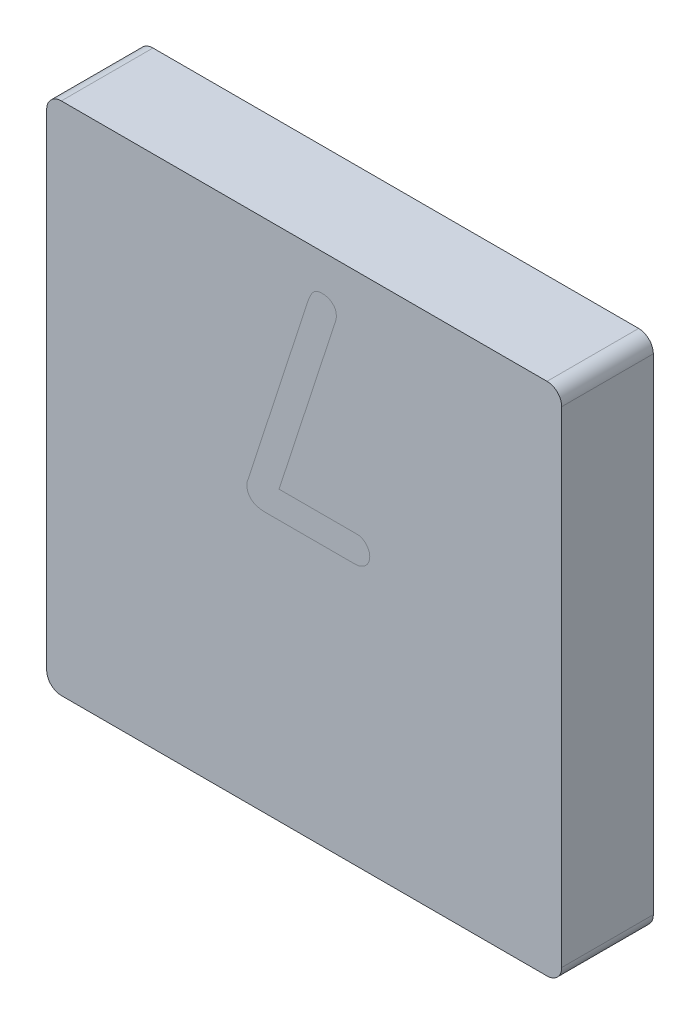
ISO-10303-21;
HEADER;
FILE_DESCRIPTION(('STEP AP214'),'2;1');
FILE_NAME('part.step','',(''),(''),'','','');
FILE_SCHEMA(('AUTOMOTIVE_DESIGN { 1 0 10303 214 1 1 1 1 }'));
ENDSEC;
DATA;
#1=APPLICATION_CONTEXT('core data for automotive mechanical design processes');
#2=APPLICATION_PROTOCOL_DEFINITION('international standard','automotive_design',2000,#1);
#3=PRODUCT_CONTEXT('',#1,'mechanical');
#4=PRODUCT('Part','Part','',(#3));
#5=PRODUCT_RELATED_PRODUCT_CATEGORY('part','',(#4));
#6=PRODUCT_DEFINITION_FORMATION('','',#4);
#7=PRODUCT_DEFINITION_CONTEXT('part definition',#1,'design');
#8=PRODUCT_DEFINITION('design','',#6,#7);
#9=PRODUCT_DEFINITION_SHAPE('','',#8);
#10=(LENGTH_UNIT() NAMED_UNIT(*) SI_UNIT(.MILLI.,.METRE.));
#11=(NAMED_UNIT(*) PLANE_ANGLE_UNIT() SI_UNIT($,.RADIAN.));
#12=(NAMED_UNIT(*) SI_UNIT($,.STERADIAN.) SOLID_ANGLE_UNIT());
#13=UNCERTAINTY_MEASURE_WITH_UNIT(LENGTH_MEASURE(1.E-05),#10,'distance_accuracy_value','');
#14=(GEOMETRIC_REPRESENTATION_CONTEXT(3) GLOBAL_UNCERTAINTY_ASSIGNED_CONTEXT((#13)) GLOBAL_UNIT_ASSIGNED_CONTEXT((#10,
#11,#12)) REPRESENTATION_CONTEXT('',''));
#15=CARTESIAN_POINT('',(0.,0.,0.));
#16=DIRECTION('',(0.,0.,1.));
#17=DIRECTION('',(1.,0.,0.));
#18=AXIS2_PLACEMENT_3D('',#15,#16,#17);
#19=CARTESIAN_POINT('',(4.207,4.207,1.58750000000002));
#20=DIRECTION('',(0.,0.,1.));
#21=DIRECTION('',(1.,0.,0.));
#22=AXIS2_PLACEMENT_3D('',#19,#20,#21);
#23=PLANE('',#22);
#24=CARTESIAN_POINT('',(4.207,4.207,1.58750000000002));
#25=DIRECTION('',(0.,0.,1.));
#26=DIRECTION('',(1.,0.,0.));
#27=AXIS2_PLACEMENT_3D('',#24,#25,#26);
#28=CIRCLE('',#27,0.254000000000002);
#29=CARTESIAN_POINT('',(4.46100000000001,4.207,1.58750000000002));
#30=VERTEX_POINT('',#29);
#31=CARTESIAN_POINT('',(4.207,4.46099999999999,1.58750000000002));
#32=VERTEX_POINT('',#31);
#33=EDGE_CURVE('E151',#30,#32,#28,.T.);
#34=ORIENTED_EDGE('',*,*,#33,.T.);
#35=DIRECTION('',(-1.,0.,0.));
#36=VECTOR('',#35,1.);
#37=CARTESIAN_POINT('',(4.207,4.46099999999999,1.58750000000002));
#38=LINE('',#37,#36);
#39=CARTESIAN_POINT('',(-4.207,4.46099999999999,1.58750000000002));
#40=VERTEX_POINT('',#39);
#41=EDGE_CURVE('E140',#32,#40,#38,.T.);
#42=ORIENTED_EDGE('',*,*,#41,.T.);
#43=CARTESIAN_POINT('',(-4.207,4.207,1.58750000000002));
#44=DIRECTION('',(0.,0.,1.));
#45=DIRECTION('',(1.,0.,0.));
#46=AXIS2_PLACEMENT_3D('',#43,#44,#45);
#47=CIRCLE('',#46,0.254);
#48=CARTESIAN_POINT('',(-4.46100000000001,4.207,1.58750000000002));
#49=VERTEX_POINT('',#48);
#50=EDGE_CURVE('E150',#40,#49,#47,.T.);
#51=ORIENTED_EDGE('',*,*,#50,.T.);
#52=DIRECTION('',(0.,-1.,0.));
#53=VECTOR('',#52,1.);
#54=CARTESIAN_POINT('',(-4.46100000000001,4.207,1.58750000000002));
#55=LINE('',#54,#53);
#56=CARTESIAN_POINT('',(-4.46100000000001,-4.207,1.58750000000002));
#57=VERTEX_POINT('',#56);
#58=EDGE_CURVE('E334',#49,#57,#55,.T.);
#59=ORIENTED_EDGE('',*,*,#58,.T.);
#60=CARTESIAN_POINT('',(-4.207,-4.207,1.58750000000002));
#61=DIRECTION('',(0.,0.,1.));
#62=DIRECTION('',(1.,0.,0.));
#63=AXIS2_PLACEMENT_3D('',#60,#61,#62);
#64=CIRCLE('',#63,0.254000000000003);
#65=CARTESIAN_POINT('',(-4.207,-4.46100000000001,1.58750000000002));
#66=VERTEX_POINT('',#65);
#67=EDGE_CURVE('E348',#57,#66,#64,.T.);
#68=ORIENTED_EDGE('',*,*,#67,.T.);
#69=DIRECTION('',(1.,0.,0.));
#70=VECTOR('',#69,1.);
#71=CARTESIAN_POINT('',(-4.207,-4.46099999999999,1.58750000000002));
#72=LINE('',#71,#70);
#73=CARTESIAN_POINT('',(4.207,-4.46099999999999,1.58750000000002));
#74=VERTEX_POINT('',#73);
#75=EDGE_CURVE('E346',#66,#74,#72,.T.);
#76=ORIENTED_EDGE('',*,*,#75,.T.);
#77=CARTESIAN_POINT('',(4.207,-4.207,1.58750000000002));
#78=DIRECTION('',(0.,0.,1.));
#79=DIRECTION('',(1.,0.,0.));
#80=AXIS2_PLACEMENT_3D('',#77,#78,#79);
#81=CIRCLE('',#80,0.254);
#82=CARTESIAN_POINT('',(4.46100000000001,-4.207,1.58750000000002));
#83=VERTEX_POINT('',#82);
#84=EDGE_CURVE('E350',#74,#83,#81,.T.);
#85=ORIENTED_EDGE('',*,*,#84,.T.);
#86=DIRECTION('',(0.,1.,0.));
#87=VECTOR('',#86,1.);
#88=CARTESIAN_POINT('',(4.46100000000001,-4.207,1.58750000000002));
#89=LINE('',#88,#87);
#90=EDGE_CURVE('E156',#83,#30,#89,.T.);
#91=ORIENTED_EDGE('',*,*,#90,.T.);
#92=EDGE_LOOP('',(#34,#42,#51,#59,#68,#76,#85,#91));
#93=FACE_BOUND('',#92,.T.);
#94=DIRECTION('',(-0.309222416613716,-0.950989746034926,0.));
#95=VECTOR('',#94,1.);
#96=CARTESIAN_POINT('',(1.09230443226494,5.21976979534929,1.58750000000002));
#97=LINE('',#96,#95);
#98=CARTESIAN_POINT('',(0.512438674508044,3.43643728103016,1.58750000000002));
#99=VERTEX_POINT('',#98);
#100=CARTESIAN_POINT('',(-0.435348841176977,0.521589713680826,1.58750000000002));
#101=VERTEX_POINT('',#100);
#102=EDGE_CURVE('E49',#99,#101,#97,.T.);
#103=ORIENTED_EDGE('',*,*,#102,.T.);
#104=DIRECTION('',(0.999999999999225,-1.24544323449292E-06,0.));
#105=VECTOR('',#104,1.);
#106=CARTESIAN_POINT('',(4.20699541002349,0.521583931904587,1.58750000000002));
#107=LINE('',#106,#105);
#108=CARTESIAN_POINT('',(0.852277973472496,0.521588110014723,1.58750000000002));
#109=VERTEX_POINT('',#108);
#110=EDGE_CURVE('E11',#101,#109,#107,.T.);
#111=ORIENTED_EDGE('',*,*,#110,.T.);
#112=CARTESIAN_POINT('',(1.00007184170472,0.504345492054289,1.58750000000002));
#113=CARTESIAN_POINT('',(0.991697495146514,0.507963446719439,1.58750000000002));
#114=CARTESIAN_POINT('',(0.975615751850768,0.514911214855862,1.58750000000002));
#115=CARTESIAN_POINT('',(0.946108342943654,0.520465651645374,1.58750000000002));
#116=CARTESIAN_POINT('',(0.905089407239545,0.520800409618521,1.58750000000002));
#117=CARTESIAN_POINT('',(0.872522688656494,0.521286153240708,1.58750000000002));
#118=CARTESIAN_POINT('',(0.852277973472496,0.521588110014723,1.58750000000002));
#119=B_SPLINE_CURVE_WITH_KNOTS('',3,(#112,#113,#114,#115,#116,#117,#118),.UNSPECIFIED.,.F.,.F.,
(4,1,1,1,4),(0.,0.181760158057884,0.349044571175198,0.595341261649439,1.),.UNSPECIFIED.);
#120=CARTESIAN_POINT('',(1.00007184170472,0.504345492054289,1.58750000000002));
#121=VERTEX_POINT('',#120);
#122=EDGE_CURVE('E164',#109,#121,#119,.F.);
#123=ORIENTED_EDGE('',*,*,#122,.T.);
#124=CARTESIAN_POINT('',(1.13637063129666,0.293328691300498,1.58750000000002));
#125=CARTESIAN_POINT('',(1.13454225660089,0.315891885064215,1.58750000000002));
#126=CARTESIAN_POINT('',(1.13090621240871,0.360762758540759,1.58750000000002));
#127=CARTESIAN_POINT('',(1.09970362721891,0.420743053288375,1.58750000000002));
#128=CARTESIAN_POINT('',(1.05811085615027,0.473144865431305,1.58750000000002));
#129=CARTESIAN_POINT('',(1.01933048817938,0.493992424489997,1.58750000000002));
#130=CARTESIAN_POINT('',(1.00007184170472,0.504345492054289,1.58750000000002));
#131=B_SPLINE_CURVE_WITH_KNOTS('',3,(#124,#125,#126,#127,#128,#129,#130),.UNSPECIFIED.,.F.,.F.,
(4,1,1,1,4),(0.,0.254240813759355,0.505602509389392,0.754478180898699,1.),.UNSPECIFIED.);
#132=CARTESIAN_POINT('',(1.13637063129666,0.293328691300498,1.58750000000002));
#133=VERTEX_POINT('',#132);
#134=EDGE_CURVE('E168',#121,#133,#131,.F.);
#135=ORIENTED_EDGE('',*,*,#134,.T.);
#136=CARTESIAN_POINT('',(0.971334145104009,0.0716378889521613,1.58750000000002));
#137=CARTESIAN_POINT('',(0.995452004098112,0.0826025554476473,1.58750000000002));
#138=CARTESIAN_POINT('',(1.04120556890481,0.103403430815857,1.58750000000002));
#139=CARTESIAN_POINT('',(1.09466482083021,0.155193860475147,1.58750000000002));
#140=CARTESIAN_POINT('',(1.12920650305696,0.219969691161115,1.58750000000002));
#141=CARTESIAN_POINT('',(1.13392260130277,0.268261435850209,1.58750000000002));
#142=CARTESIAN_POINT('',(1.13637063129666,0.293328691300498,1.58750000000002));
#143=B_SPLINE_CURVE_WITH_KNOTS('',3,(#136,#137,#138,#139,#140,#141,#142),.UNSPECIFIED.,.F.,.F.,
(4,1,1,1,4),(0.,0.268477384834813,0.509323710250489,0.745299989102933,1.),.UNSPECIFIED.);
#144=CARTESIAN_POINT('',(0.971334145104009,0.0716378889521613,1.58750000000002));
#145=VERTEX_POINT('',#144);
#146=EDGE_CURVE('E184',#133,#145,#143,.F.);
#147=ORIENTED_EDGE('',*,*,#146,.T.);
#148=CARTESIAN_POINT('',(0.801882766124432,0.0552171498705289,1.58750000000002));
#149=CARTESIAN_POINT('',(0.823886136588473,0.0551159039009347,1.58750000000002));
#150=CARTESIAN_POINT('',(0.860682263173637,0.0549465907714181,1.58750000000002));
#151=CARTESIAN_POINT('',(0.907957907446015,0.0558184733714107,1.58750000000002));
#152=CARTESIAN_POINT('',(0.943122203816406,0.0603831142720196,1.58750000000002));
#153=CARTESIAN_POINT('',(0.962135560278118,0.067968237206617,1.58750000000002));
#154=CARTESIAN_POINT('',(0.971334145104009,0.0716378889521613,1.58750000000002));
#155=B_SPLINE_CURVE_WITH_KNOTS('',3,(#148,#149,#150,#151,#152,#153,#154),.UNSPECIFIED.,.F.,.F.,
(4,1,1,1,4),(0.,0.384688684528218,0.643312966752675,0.827436258388912,1.),.UNSPECIFIED.);
#156=CARTESIAN_POINT('',(0.801882766124432,0.0552171498705289,1.58750000000002));
#157=VERTEX_POINT('',#156);
#158=EDGE_CURVE('E193',#145,#157,#155,.F.);
#159=ORIENTED_EDGE('',*,*,#158,.T.);
#160=DIRECTION('',(-0.99999999999985,-5.47516192907888E-07,0.));
#161=VECTOR('',#160,1.);
#162=CARTESIAN_POINT('',(4.20700227316732,0.0552190142285996,1.58750000000002));
#163=LINE('',#162,#161);
#164=CARTESIAN_POINT('',(-0.662609175907804,0.0552163480374707,1.58750000000002));
#165=VERTEX_POINT('',#164);
#166=EDGE_CURVE('E202',#157,#165,#163,.T.);
#167=ORIENTED_EDGE('',*,*,#166,.T.);
#168=CARTESIAN_POINT('',(-0.991861071247373,0.310571309260932,1.58750000000002));
#169=CARTESIAN_POINT('',(-0.990725733000006,0.29076498491365,1.58750000000002));
#170=CARTESIAN_POINT('',(-0.988557647972899,0.252942075874035,1.58750000000002));
#171=CARTESIAN_POINT('',(-0.973052143044051,0.199759914801451,1.58750000000002));
#172=CARTESIAN_POINT('',(-0.945795671818218,0.154871630157205,1.58750000000002));
#173=CARTESIAN_POINT('',(-0.908740210579739,0.117808826928162,1.58750000000002));
#174=CARTESIAN_POINT('',(-0.861085160899736,0.0893661366867249,1.58750000000002));
#175=CARTESIAN_POINT('',(-0.803339592421445,0.0704125067194084,1.58750000000002));
#176=CARTESIAN_POINT('',(-0.736191145501885,0.0581118285341853,1.58750000000002));
#177=CARTESIAN_POINT('',(-0.688123579681649,0.0562203502260522,1.58750000000002));
#178=CARTESIAN_POINT('',(-0.662609175907804,0.0552163480374707,1.58750000000002));
#179=B_SPLINE_CURVE_WITH_KNOTS('',3,(#168,#169,#170,#171,#172,#173,#174,#175,#176,#177,#178),
.UNSPECIFIED.,.F.,.F.,(4,1,1,1,1,1,1,1,4),(0.,0.125498406788053,0.23965652290319,
0.347063440867895,0.455015397762931,0.568671485243392,0.695410826787818,0.838323180758934,1.),.UNSPECIFIED.);
#180=CARTESIAN_POINT('',(-0.991861071247373,0.310571309260932,1.58750000000002));
#181=VERTEX_POINT('',#180);
#182=EDGE_CURVE('E209',#165,#181,#179,.F.);
#183=ORIENTED_EDGE('',*,*,#182,.T.);
#184=CARTESIAN_POINT('',(-0.968834029646391,0.410551872574064,1.58750000000002));
#185=CARTESIAN_POINT('',(-0.973277138125818,0.398880187734263,1.58750000000002));
#186=CARTESIAN_POINT('',(-0.980673785100757,0.379449797330234,1.58750000000002));
#187=CARTESIAN_POINT('',(-0.989856114535864,0.353472389273538,1.58750000000002));
#188=CARTESIAN_POINT('',(-0.992354267948803,0.331422286339256,1.58750000000002));
#189=CARTESIAN_POINT('',(-0.992029382801872,0.317687051022225,1.58750000000002));
#190=CARTESIAN_POINT('',(-0.991861071247373,0.310571309260932,1.58750000000002));
#191=B_SPLINE_CURVE_WITH_KNOTS('',3,(#184,#185,#186,#187,#188,#189,#190),.UNSPECIFIED.,.F.,.F.,
(4,1,1,1,4),(0.,0.361866898991394,0.602416464993032,0.794025970553256,1.),.UNSPECIFIED.);
#192=CARTESIAN_POINT('',(-0.968834029646391,0.410551872574064,1.58750000000002));
#193=VERTEX_POINT('',#192);
#194=EDGE_CURVE('E215',#181,#193,#191,.F.);
#195=ORIENTED_EDGE('',*,*,#194,.T.);
#196=DIRECTION('',(0.308858184046078,0.951108102240623,0.));
#197=VECTOR('',#196,1.);
#198=CARTESIAN_POINT('',(0.640141453261155,5.36528416443906,1.58750000000002));
#199=LINE('',#198,#197);
#200=CARTESIAN_POINT('',(0.0582964702471531,3.57353148901016,1.58750000000002));
#201=VERTEX_POINT('',#200);
#202=EDGE_CURVE('E224',#193,#201,#199,.T.);
#203=ORIENTED_EDGE('',*,*,#202,.T.);
#204=CARTESIAN_POINT('',(0.325146510110896,3.83217075841655,1.58750000000002));
#205=CARTESIAN_POINT('',(0.308955036949415,3.83221539515127,1.58750000000002));
#206=CARTESIAN_POINT('',(0.278185689554067,3.83230022024307,1.58750000000002));
#207=CARTESIAN_POINT('',(0.234589990729395,3.82319294264365,1.58750000000002));
#208=CARTESIAN_POINT('',(0.196596965456666,3.80668505839733,1.58750000000002));
#209=CARTESIAN_POINT('',(0.163546654677799,3.78143495971875,1.58750000000002));
#210=CARTESIAN_POINT('',(0.135331394142721,3.7457288329321,1.58750000000002));
#211=CARTESIAN_POINT('',(0.108055688902396,3.69964426113635,1.58750000000002));
#212=CARTESIAN_POINT('',(0.082431586213412,3.64087852940474,1.58750000000002));
#213=CARTESIAN_POINT('',(0.0667687666005418,3.59717272966316,1.58750000000002));
#214=CARTESIAN_POINT('',(0.0582964702471531,3.57353148901016,1.58750000000002));
#215=B_SPLINE_CURVE_WITH_KNOTS('',3,(#204,#205,#206,#207,#208,#209,#210,#211,#212,#213,#214),
.UNSPECIFIED.,.F.,.F.,(4,1,1,1,1,1,1,1,4),(0.,0.11895441220544,0.226054145713362,
0.325282327952042,0.421603612629503,0.528930573550234,0.658174846496339,0.815100724320157,1.),.UNSPECIFIED.);
#216=CARTESIAN_POINT('',(0.325146510110896,3.83217075841655,1.58750000000002));
#217=VERTEX_POINT('',#216);
#218=EDGE_CURVE('E231',#201,#217,#215,.F.);
#219=ORIENTED_EDGE('',*,*,#218,.T.);
#220=CARTESIAN_POINT('',(0.55751131405378,3.6244382658457,1.58750000000002));
#221=CARTESIAN_POINT('',(0.556154076510787,3.6390394154783,1.58750000000002));
#222=CARTESIAN_POINT('',(0.55351230753882,3.66745954300389,1.58750000000002));
#223=CARTESIAN_POINT('',(0.540253528488827,3.70777093757024,1.58750000000002));
#224=CARTESIAN_POINT('',(0.518132344629184,3.74334100428236,1.58750000000002));
#225=CARTESIAN_POINT('',(0.488141992232148,3.77331572270762,1.58750000000002));
#226=CARTESIAN_POINT('',(0.453412283039717,3.79877459722427,1.58750000000002));
#227=CARTESIAN_POINT('',(0.41373509899012,3.8170661306569,1.58750000000002));
#228=CARTESIAN_POINT('',(0.370675267493195,3.82879385570641,1.58750000000002));
#229=CARTESIAN_POINT('',(0.340547806066974,3.8310284325319,1.58750000000002));
#230=CARTESIAN_POINT('',(0.325146510110896,3.83217075841655,1.58750000000002));
#231=B_SPLINE_CURVE_WITH_KNOTS('',3,(#220,#221,#222,#223,#224,#225,#226,#227,#228,#229,#230),
.UNSPECIFIED.,.F.,.F.,(4,1,1,1,1,1,1,1,4),(0.,0.127240171296335,0.24766418984882,
0.365231896332684,0.488100731076184,0.614267881067532,0.737780494052595,0.865952190281829,1.),.UNSPECIFIED.);
#232=CARTESIAN_POINT('',(0.55751131405378,3.6244382658457,1.58750000000002));
#233=VERTEX_POINT('',#232);
#234=EDGE_CURVE('E237',#217,#233,#231,.F.);
#235=ORIENTED_EDGE('',*,*,#234,.T.);
#236=CARTESIAN_POINT('',(0.512438674508044,3.43643728103016,1.58750000000002));
#237=CARTESIAN_POINT('',(0.520652892838862,3.45904577312028,1.58750000000002));
#238=CARTESIAN_POINT('',(0.534402370387411,3.49688929539844,1.58750000000002));
#239=CARTESIAN_POINT('',(0.549053617004067,3.54758986877618,1.58750000000002));
#240=CARTESIAN_POINT('',(0.556902109636298,3.58775927719808,1.58750000000002));
#241=CARTESIAN_POINT('',(0.557310765587411,3.61236364079349,1.58750000000002));
#242=CARTESIAN_POINT('',(0.55751131405378,3.6244382658457,1.58750000000002));
#243=B_SPLINE_CURVE_WITH_KNOTS('',3,(#236,#237,#238,#239,#240,#241,#242),.UNSPECIFIED.,.F.,.F.,
(4,1,1,1,4),(0.,0.37099823007096,0.621000274094957,0.814005366672469,1.),.UNSPECIFIED.);
#244=EDGE_CURVE('E246',#233,#99,#243,.F.);
#245=ORIENTED_EDGE('',*,*,#244,.T.);
#246=EDGE_LOOP('',(#103,#111,#123,#135,#147,#159,#167,#183,#195,#203,#219,#235,#245));
#247=FACE_BOUND('',#246,.T.);
#248=ADVANCED_FACE('F40',(#93,#247),#23,.T.);
#249=CARTESIAN_POINT('',(4.207,4.207,1.58750000000002));
#250=DIRECTION('',(0.,0.,-1.));
#251=DIRECTION('',(-1.,0.,0.));
#252=AXIS2_PLACEMENT_3D('',#249,#250,#251);
#253=CYLINDRICAL_SURFACE('',#252,0.254000000000002);
#254=CARTESIAN_POINT('',(4.207,4.207,0.));
#255=DIRECTION('',(0.,0.,1.));
#256=DIRECTION('',(1.,0.,0.));
#257=AXIS2_PLACEMENT_3D('',#254,#255,#256);
#258=CIRCLE('',#257,0.254000000000002);
#259=CARTESIAN_POINT('',(4.46100000000001,4.207,0.));
#260=VERTEX_POINT('',#259);
#261=CARTESIAN_POINT('',(4.207,4.46099999999999,0.));
#262=VERTEX_POINT('',#261);
#263=EDGE_CURVE('E163',#260,#262,#258,.T.);
#264=ORIENTED_EDGE('',*,*,#263,.T.);
#265=DIRECTION('',(0.,0.,-1.));
#266=VECTOR('',#265,1.);
#267=CARTESIAN_POINT('',(4.207,4.46099999999999,1.58750000000002));
#268=LINE('',#267,#266);
#269=EDGE_CURVE('E144',#32,#262,#268,.T.);
#270=ORIENTED_EDGE('',*,*,#269,.F.);
#271=ORIENTED_EDGE('',*,*,#33,.F.);
#272=DIRECTION('',(0.,0.,-1.));
#273=VECTOR('',#272,1.);
#274=CARTESIAN_POINT('',(4.46100000000001,4.207,1.58750000000002));
#275=LINE('',#274,#273);
#276=EDGE_CURVE('E316',#30,#260,#275,.T.);
#277=ORIENTED_EDGE('',*,*,#276,.T.);
#278=EDGE_LOOP('',(#264,#270,#271,#277));
#279=FACE_BOUND('',#278,.T.);
#280=ADVANCED_FACE('F42',(#279),#253,.T.);
#281=CARTESIAN_POINT('',(4.207,4.46099999999999,1.58750000000002));
#282=DIRECTION('',(0.,-1.,0.));
#283=DIRECTION('',(0.,0.,-1.));
#284=AXIS2_PLACEMENT_3D('',#281,#282,#283);
#285=PLANE('',#284);
#286=DIRECTION('',(-1.,0.,0.));
#287=VECTOR('',#286,1.);
#288=CARTESIAN_POINT('',(4.207,4.46099999999999,0.));
#289=LINE('',#288,#287);
#290=CARTESIAN_POINT('',(-4.207,4.46099999999999,0.));
#291=VERTEX_POINT('',#290);
#292=EDGE_CURVE('E341',#262,#291,#289,.T.);
#293=ORIENTED_EDGE('',*,*,#292,.T.);
#294=DIRECTION('',(0.,0.,-1.));
#295=VECTOR('',#294,1.);
#296=CARTESIAN_POINT('',(-4.207,4.46099999999999,1.58750000000002));
#297=LINE('',#296,#295);
#298=EDGE_CURVE('E147',#40,#291,#297,.T.);
#299=ORIENTED_EDGE('',*,*,#298,.F.);
#300=ORIENTED_EDGE('',*,*,#41,.F.);
#301=ORIENTED_EDGE('',*,*,#269,.T.);
#302=EDGE_LOOP('',(#293,#299,#300,#301));
#303=FACE_BOUND('',#302,.T.);
#304=ADVANCED_FACE('F142',(#303),#285,.F.);
#305=CARTESIAN_POINT('',(-4.207,4.207,1.58750000000002));
#306=DIRECTION('',(0.,0.,-1.));
#307=DIRECTION('',(-1.,0.,0.));
#308=AXIS2_PLACEMENT_3D('',#305,#306,#307);
#309=CYLINDRICAL_SURFACE('',#308,0.254);
#310=CARTESIAN_POINT('',(-4.207,4.207,0.));
#311=DIRECTION('',(0.,0.,1.));
#312=DIRECTION('',(1.,0.,0.));
#313=AXIS2_PLACEMENT_3D('',#310,#311,#312);
#314=CIRCLE('',#313,0.254);
#315=CARTESIAN_POINT('',(-4.46100000000001,4.207,0.));
#316=VERTEX_POINT('',#315);
#317=EDGE_CURVE('E337',#291,#316,#314,.T.);
#318=ORIENTED_EDGE('',*,*,#317,.T.);
#319=DIRECTION('',(0.,0.,-1.));
#320=VECTOR('',#319,1.);
#321=CARTESIAN_POINT('',(-4.46100000000001,4.207,1.58750000000002));
#322=LINE('',#321,#320);
#323=EDGE_CURVE('E170',#49,#316,#322,.T.);
#324=ORIENTED_EDGE('',*,*,#323,.F.);
#325=ORIENTED_EDGE('',*,*,#50,.F.);
#326=ORIENTED_EDGE('',*,*,#298,.T.);
#327=EDGE_LOOP('',(#318,#324,#325,#326));
#328=FACE_BOUND('',#327,.T.);
#329=ADVANCED_FACE('F280',(#328),#309,.T.);
#330=CARTESIAN_POINT('',(-4.46100000000001,4.207,1.58750000000002));
#331=DIRECTION('',(1.,0.,0.));
#332=DIRECTION('',(0.,0.,-1.));
#333=AXIS2_PLACEMENT_3D('',#330,#331,#332);
#334=PLANE('',#333);
#335=DIRECTION('',(0.,-1.,0.));
#336=VECTOR('',#335,1.);
#337=CARTESIAN_POINT('',(-4.46100000000001,4.207,0.));
#338=LINE('',#337,#336);
#339=CARTESIAN_POINT('',(-4.46100000000001,-4.207,0.));
#340=VERTEX_POINT('',#339);
#341=EDGE_CURVE('E333',#316,#340,#338,.T.);
#342=ORIENTED_EDGE('',*,*,#341,.T.);
#343=DIRECTION('',(0.,0.,-1.));
#344=VECTOR('',#343,1.);
#345=CARTESIAN_POINT('',(-4.46100000000001,-4.207,1.58750000000002));
#346=LINE('',#345,#344);
#347=EDGE_CURVE('E326',#57,#340,#346,.T.);
#348=ORIENTED_EDGE('',*,*,#347,.F.);
#349=ORIENTED_EDGE('',*,*,#58,.F.);
#350=ORIENTED_EDGE('',*,*,#323,.T.);
#351=EDGE_LOOP('',(#342,#348,#349,#350));
#352=FACE_BOUND('',#351,.T.);
#353=ADVANCED_FACE('F284',(#352),#334,.F.);
#354=CARTESIAN_POINT('',(-4.207,-4.207,1.58750000000002));
#355=DIRECTION('',(0.,0.,-1.));
#356=DIRECTION('',(-1.,0.,0.));
#357=AXIS2_PLACEMENT_3D('',#354,#355,#356);
#358=CYLINDRICAL_SURFACE('',#357,0.254000000000003);
#359=CARTESIAN_POINT('',(-4.207,-4.207,0.));
#360=DIRECTION('',(0.,0.,1.));
#361=DIRECTION('',(1.,0.,0.));
#362=AXIS2_PLACEMENT_3D('',#359,#360,#361);
#363=CIRCLE('',#362,0.254000000000003);
#364=CARTESIAN_POINT('',(-4.207,-4.46100000000001,0.));
#365=VERTEX_POINT('',#364);
#366=EDGE_CURVE('E338',#340,#365,#363,.T.);
#367=ORIENTED_EDGE('',*,*,#366,.T.);
#368=DIRECTION('',(0.,0.,-1.));
#369=VECTOR('',#368,1.);
#370=CARTESIAN_POINT('',(-4.207,-4.46100000000001,1.58750000000002));
#371=LINE('',#370,#369);
#372=EDGE_CURVE('E323',#66,#365,#371,.T.);
#373=ORIENTED_EDGE('',*,*,#372,.F.);
#374=ORIENTED_EDGE('',*,*,#67,.F.);
#375=ORIENTED_EDGE('',*,*,#347,.T.);
#376=EDGE_LOOP('',(#367,#373,#374,#375));
#377=FACE_BOUND('',#376,.T.);
#378=ADVANCED_FACE('F290',(#377),#358,.T.);
#379=CARTESIAN_POINT('',(-4.207,-4.46099999999999,1.58750000000002));
#380=DIRECTION('',(0.,1.,0.));
#381=DIRECTION('',(0.,0.,1.));
#382=AXIS2_PLACEMENT_3D('',#379,#380,#381);
#383=PLANE('',#382);
#384=DIRECTION('',(1.,0.,0.));
#385=VECTOR('',#384,1.);
#386=CARTESIAN_POINT('',(-4.207,-4.46099999999999,0.));
#387=LINE('',#386,#385);
#388=CARTESIAN_POINT('',(4.207,-4.46099999999999,0.));
#389=VERTEX_POINT('',#388);
#390=EDGE_CURVE('E314',#365,#389,#387,.T.);
#391=ORIENTED_EDGE('',*,*,#390,.T.);
#392=DIRECTION('',(0.,0.,-1.));
#393=VECTOR('',#392,1.);
#394=CARTESIAN_POINT('',(4.207,-4.46099999999999,1.58750000000002));
#395=LINE('',#394,#393);
#396=EDGE_CURVE('E311',#74,#389,#395,.T.);
#397=ORIENTED_EDGE('',*,*,#396,.F.);
#398=ORIENTED_EDGE('',*,*,#75,.F.);
#399=ORIENTED_EDGE('',*,*,#372,.T.);
#400=EDGE_LOOP('',(#391,#397,#398,#399));
#401=FACE_BOUND('',#400,.T.);
#402=ADVANCED_FACE('F294',(#401),#383,.F.);
#403=CARTESIAN_POINT('',(4.207,-4.207,1.58750000000002));
#404=DIRECTION('',(0.,0.,-1.));
#405=DIRECTION('',(-1.,0.,0.));
#406=AXIS2_PLACEMENT_3D('',#403,#404,#405);
#407=CYLINDRICAL_SURFACE('',#406,0.254);
#408=CARTESIAN_POINT('',(4.207,-4.207,0.));
#409=DIRECTION('',(0.,0.,1.));
#410=DIRECTION('',(1.,0.,0.));
#411=AXIS2_PLACEMENT_3D('',#408,#409,#410);
#412=CIRCLE('',#411,0.254);
#413=CARTESIAN_POINT('',(4.46100000000001,-4.207,0.));
#414=VERTEX_POINT('',#413);
#415=EDGE_CURVE('E306',#389,#414,#412,.T.);
#416=ORIENTED_EDGE('',*,*,#415,.T.);
#417=DIRECTION('',(0.,0.,-1.));
#418=VECTOR('',#417,1.);
#419=CARTESIAN_POINT('',(4.46100000000001,-4.207,1.58750000000002));
#420=LINE('',#419,#418);
#421=EDGE_CURVE('E309',#83,#414,#420,.T.);
#422=ORIENTED_EDGE('',*,*,#421,.F.);
#423=ORIENTED_EDGE('',*,*,#84,.F.);
#424=ORIENTED_EDGE('',*,*,#396,.T.);
#425=EDGE_LOOP('',(#416,#422,#423,#424));
#426=FACE_BOUND('',#425,.T.);
#427=ADVANCED_FACE('F270',(#426),#407,.T.);
#428=CARTESIAN_POINT('',(4.46100000000001,-4.207,1.58750000000002));
#429=DIRECTION('',(-1.,0.,0.));
#430=DIRECTION('',(0.,0.,1.));
#431=AXIS2_PLACEMENT_3D('',#428,#429,#430);
#432=PLANE('',#431);
#433=DIRECTION('',(0.,1.,0.));
#434=VECTOR('',#433,1.);
#435=CARTESIAN_POINT('',(4.46100000000001,-4.207,0.));
#436=LINE('',#435,#434);
#437=EDGE_CURVE('E160',#414,#260,#436,.T.);
#438=ORIENTED_EDGE('',*,*,#437,.T.);
#439=ORIENTED_EDGE('',*,*,#276,.F.);
#440=ORIENTED_EDGE('',*,*,#90,.F.);
#441=ORIENTED_EDGE('',*,*,#421,.T.);
#442=EDGE_LOOP('',(#438,#439,#440,#441));
#443=FACE_BOUND('',#442,.T.);
#444=ADVANCED_FACE('F262',(#443),#432,.F.);
#445=ORIENTED_EDGE('',*,*,#110,.F.);
#446=ORIENTED_EDGE('',*,*,#102,.F.);
#447=ORIENTED_EDGE('',*,*,#244,.F.);
#448=ORIENTED_EDGE('',*,*,#234,.F.);
#449=ORIENTED_EDGE('',*,*,#218,.F.);
#450=ORIENTED_EDGE('',*,*,#202,.F.);
#451=ORIENTED_EDGE('',*,*,#194,.F.);
#452=ORIENTED_EDGE('',*,*,#182,.F.);
#453=ORIENTED_EDGE('',*,*,#166,.F.);
#454=ORIENTED_EDGE('',*,*,#158,.F.);
#455=ORIENTED_EDGE('',*,*,#146,.F.);
#456=ORIENTED_EDGE('',*,*,#134,.F.);
#457=ORIENTED_EDGE('',*,*,#122,.F.);
#458=EDGE_LOOP('',(#445,#446,#447,#448,#449,#450,#451,#452,#453,#454,#455,#456,#457));
#459=FACE_BOUND('',#458,.T.);
#460=ADVANCED_FACE('F259',(#459),#23,.T.);
#461=CARTESIAN_POINT('',(4.207,4.207,0.));
#462=DIRECTION('',(0.,0.,1.));
#463=DIRECTION('',(1.,0.,0.));
#464=AXIS2_PLACEMENT_3D('',#461,#462,#463);
#465=PLANE('',#464);
#466=ORIENTED_EDGE('',*,*,#263,.F.);
#467=ORIENTED_EDGE('',*,*,#437,.F.);
#468=ORIENTED_EDGE('',*,*,#415,.F.);
#469=ORIENTED_EDGE('',*,*,#390,.F.);
#470=ORIENTED_EDGE('',*,*,#366,.F.);
#471=ORIENTED_EDGE('',*,*,#341,.F.);
#472=ORIENTED_EDGE('',*,*,#317,.F.);
#473=ORIENTED_EDGE('',*,*,#292,.F.);
#474=EDGE_LOOP('',(#466,#467,#468,#469,#470,#471,#472,#473));
#475=FACE_BOUND('',#474,.T.);
#476=ADVANCED_FACE('F261',(#475),#465,.F.);
#477=CLOSED_SHELL('',(#248,#280,#304,#329,#353,#378,#402,#427,#444,#460,#476));
#478=MANIFOLD_SOLID_BREP('B2',#477);
#479=ADVANCED_BREP_SHAPE_REPRESENTATION('',(#18,#478),#14);
#480=SHAPE_DEFINITION_REPRESENTATION(#9,#479);
ENDSEC;
END-ISO-10303-21;
